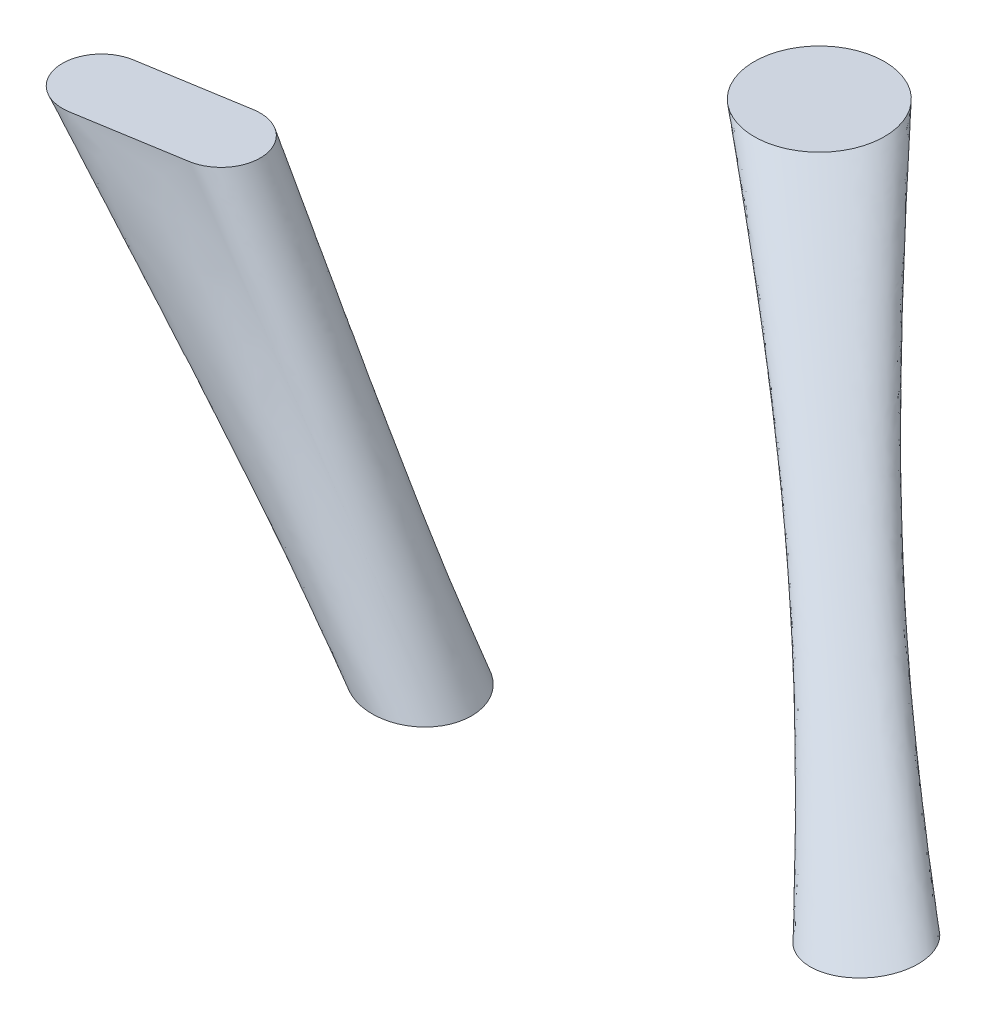
ISO-10303-21;
HEADER;
FILE_DESCRIPTION(('STEP AP214'),'2;1');
FILE_NAME('part.step','',(''),(''),'','','');
FILE_SCHEMA(('AUTOMOTIVE_DESIGN { 1 0 10303 214 1 1 1 1 }'));
ENDSEC;
DATA;
#1=APPLICATION_CONTEXT('core data for automotive mechanical design processes');
#2=APPLICATION_PROTOCOL_DEFINITION('international standard','automotive_design',2000,#1);
#3=PRODUCT_CONTEXT('',#1,'mechanical');
#4=PRODUCT('Part','Part','',(#3));
#5=PRODUCT_RELATED_PRODUCT_CATEGORY('part','',(#4));
#6=PRODUCT_DEFINITION_FORMATION('','',#4);
#7=PRODUCT_DEFINITION_CONTEXT('part definition',#1,'design');
#8=PRODUCT_DEFINITION('design','',#6,#7);
#9=PRODUCT_DEFINITION_SHAPE('','',#8);
#10=(LENGTH_UNIT() NAMED_UNIT(*) SI_UNIT(.MILLI.,.METRE.));
#11=(NAMED_UNIT(*) PLANE_ANGLE_UNIT() SI_UNIT($,.RADIAN.));
#12=(NAMED_UNIT(*) SI_UNIT($,.STERADIAN.) SOLID_ANGLE_UNIT());
#13=UNCERTAINTY_MEASURE_WITH_UNIT(LENGTH_MEASURE(1.E-05),#10,'distance_accuracy_value','');
#14=(GEOMETRIC_REPRESENTATION_CONTEXT(3) GLOBAL_UNCERTAINTY_ASSIGNED_CONTEXT((#13)) GLOBAL_UNIT_ASSIGNED_CONTEXT((#10,
#11,#12)) REPRESENTATION_CONTEXT('',''));
#15=CARTESIAN_POINT('',(0.,0.,0.));
#16=DIRECTION('',(0.,0.,1.));
#17=DIRECTION('',(1.,0.,0.));
#18=AXIS2_PLACEMENT_3D('',#15,#16,#17);
#19=CARTESIAN_POINT('',(-0.924999999999996,-1.85,-1.60214699700121));
#20=DIRECTION('',(0.,-1.,0.));
#21=DIRECTION('',(0.,0.,-1.));
#22=AXIS2_PLACEMENT_3D('',#19,#20,#21);
#23=PLANE('',#22);
#24=CARTESIAN_POINT('',(-0.924999999999996,-1.85,-1.60214699700121));
#25=DIRECTION('',(0.,-1.,0.));
#26=DIRECTION('',(0.,0.,-1.));
#27=AXIS2_PLACEMENT_3D('',#24,#25,#26);
#28=CIRCLE('',#27,0.25);
#29=CARTESIAN_POINT('',(-0.924999999999997,-1.85,-1.85214699700121));
#30=VERTEX_POINT('',#29);
#31=EDGE_CURVE('E12',#30,#30,#28,.T.);
#32=ORIENTED_EDGE('',*,*,#31,.F.);
#33=EDGE_LOOP('',(#32));
#34=FACE_BOUND('',#33,.T.);
#35=ADVANCED_FACE('F134',(#34),#23,.F.);
#36=CARTESIAN_POINT('',(0.857526099764511,-2.95078566716686,0.));
#37=DIRECTION('',(-0.0813272872809653,0.996687449676938,0.));
#38=DIRECTION('',(-0.996687449676938,-0.0813272872809654,0.));
#39=AXIS2_PLACEMENT_3D('',#36,#37,#38);
#40=PLANE('',#39);
#41=CARTESIAN_POINT('',(0.857526099764511,-2.95078566716686,0.));
#42=DIRECTION('',(-0.0813272872809653,0.996687449676938,0.));
#43=DIRECTION('',(-0.996687449676938,-0.0813272872809654,0.));
#44=AXIS2_PLACEMENT_3D('',#41,#42,#43);
#45=CIRCLE('',#44,0.2);
#46=CARTESIAN_POINT('',(0.658188609829123,-2.96705112462305,0.));
#47=VERTEX_POINT('',#46);
#48=EDGE_CURVE('E142',#47,#47,#45,.T.);
#49=ORIENTED_EDGE('',*,*,#48,.F.);
#50=EDGE_LOOP('',(#49));
#51=FACE_BOUND('',#50,.T.);
#52=ADVANCED_FACE('F167',(#51),#40,.F.);
#53=CARTESIAN_POINT('',(0.658188609829123,-2.96705112462305,0.));
#54=CARTESIAN_POINT('',(-0.924999999999997,-1.85,-1.85214699700121));
#55=CARTESIAN_POINT('',(0.658188609829123,-2.96705112462305,0.0333333333333333));
#56=CARTESIAN_POINT('',(-0.966666666666664,-1.85,-1.85214699700121));
#57=CARTESIAN_POINT('',(0.666162109426539,-2.96640050632481,0.0773333333333334));
#58=CARTESIAN_POINT('',(-1.02166666666666,-1.85,-1.84214699700121));
#59=CARTESIAN_POINT('',(0.714003107011032,-2.96249679653532,0.141333333333333));
#60=CARTESIAN_POINT('',(-1.10166666666666,-1.85,-1.78214699700121));
#61=CARTESIAN_POINT('',(0.73613025814296,-2.96069127447582,0.161707035755479));
#62=CARTESIAN_POINT('',(-1.12713379469434,-1.85,-1.75439613194931));
#63=CARTESIAN_POINT('',(0.791310186152756,-2.95618872569902,0.19123414071511));
#64=CARTESIAN_POINT('',(-1.16404267589388,-1.85,-1.68519197970018));
#65=CARTESIAN_POINT('',(0.82430318477528,-2.95349657674289,0.2));
#66=CARTESIAN_POINT('',(-1.175,-1.85,-1.64381366366788));
#67=CARTESIAN_POINT('',(0.890749014753742,-2.94807475759083,0.2));
#68=CARTESIAN_POINT('',(-1.175,-1.85,-1.56048033033455));
#69=CARTESIAN_POINT('',(0.923742013376266,-2.9453826086347,0.19123414071511));
#70=CARTESIAN_POINT('',(-1.16404267589388,-1.85,-1.51910201430225));
#71=CARTESIAN_POINT('',(0.978921941386062,-2.9408800598579,0.161707035755479));
#72=CARTESIAN_POINT('',(-1.12713379469434,-1.85,-1.44989786205312));
#73=CARTESIAN_POINT('',(1.00104909251799,-2.9390745377984,0.141333333333333));
#74=CARTESIAN_POINT('',(-1.10166666666666,-1.85,-1.42214699700121));
#75=CARTESIAN_POINT('',(1.04889009010248,-2.93517082800891,0.0773333333333335));
#76=CARTESIAN_POINT('',(-1.02166666666666,-1.85,-1.36214699700121));
#77=CARTESIAN_POINT('',(1.0568635896999,-2.93452020971066,0.0333333333333333));
#78=CARTESIAN_POINT('',(-0.966666666666663,-1.85,-1.35214699700121));
#79=CARTESIAN_POINT('',(1.0568635896999,-2.93452020971067,-0.0333333333333334));
#80=CARTESIAN_POINT('',(-0.88333333333333,-1.85,-1.35214699700121));
#81=CARTESIAN_POINT('',(1.04889009010248,-2.93517082800891,-0.0773333333333333));
#82=CARTESIAN_POINT('',(-0.82833333333333,-1.85,-1.36214699700121));
#83=CARTESIAN_POINT('',(1.00104909251799,-2.9390745377984,-0.141333333333333));
#84=CARTESIAN_POINT('',(-0.74833333333333,-1.85,-1.42214699700121));
#85=CARTESIAN_POINT('',(0.978921941386062,-2.9408800598579,-0.161707035755479));
#86=CARTESIAN_POINT('',(-0.722866205305648,-1.85,-1.44989786205312));
#87=CARTESIAN_POINT('',(0.923742013376266,-2.9453826086347,-0.19123414071511));
#88=CARTESIAN_POINT('',(-0.68595732410611,-1.85,-1.51910201430225));
#89=CARTESIAN_POINT('',(0.890749014753742,-2.94807475759083,-0.2));
#90=CARTESIAN_POINT('',(-0.674999999999996,-1.85,-1.56048033033455));
#91=CARTESIAN_POINT('',(0.82430318477528,-2.95349657674289,-0.2));
#92=CARTESIAN_POINT('',(-0.674999999999997,-1.85,-1.64381366366788));
#93=CARTESIAN_POINT('',(0.791310186152756,-2.95618872569902,-0.19123414071511));
#94=CARTESIAN_POINT('',(-0.685957324106109,-1.85,-1.68519197970018));
#95=CARTESIAN_POINT('',(0.73613025814296,-2.96069127447582,-0.161707035755479));
#96=CARTESIAN_POINT('',(-0.722866205305648,-1.85,-1.75439613194931));
#97=CARTESIAN_POINT('',(0.714003107011032,-2.96249679653532,-0.141333333333333));
#98=CARTESIAN_POINT('',(-0.74833333333333,-1.85,-1.78214699700121));
#99=CARTESIAN_POINT('',(0.666162109426539,-2.9664005063248,-0.0773333333333332));
#100=CARTESIAN_POINT('',(-0.82833333333333,-1.85,-1.84214699700121));
#101=CARTESIAN_POINT('',(0.658188609829123,-2.96705112462305,-0.0333333333333334));
#102=CARTESIAN_POINT('',(-0.88333333333333,-1.85,-1.85214699700122));
#103=CARTESIAN_POINT('',(0.658188609829123,-2.96705112462305,0.));
#104=CARTESIAN_POINT('',(-0.924999999999997,-1.85,-1.85214699700121));
#105=B_SPLINE_SURFACE_WITH_KNOTS('',3,1,((#53,#54),(#55,#56),(#57,#58),(#59,#60),(#61,#62),(#63,
#64),(#65,#66),(#67,#68),(#69,#70),(#71,#72),(#73,#74),(#75,#76),(#77,#78),(#79,#80),(#81,#82),
(#83,#84),(#85,#86),(#87,#88),(#89,#90),(#91,#92),(#93,#94),(#95,#96),(#97,#98),(#99,#100),
(#101,#102),(#103,#104)),.UNSPECIFIED.,.T.,.F.,.F.,(4,2,2,2,2,2,2,2,2,2,2,2,4),(2,2),(0.,0.125,
0.1875,0.25,0.3125,0.375,0.5,0.625,0.6875,0.75,0.8125,0.875,1.),(0.,1.),.UNSPECIFIED.);
#106=CARTESIAN_POINT('',(0.658188609829123,-2.96705112462305,0.));
#107=CARTESIAN_POINT('',(0.64169706181007,-2.95541517540823,-0.0192931978854294));
#108=CARTESIAN_POINT('',(0.625205513791017,-2.9437792261934,-0.0385863957708587));
#109=CARTESIAN_POINT('',(0.59222241775291,-2.92050732776376,-0.0771727915417173));
#110=CARTESIAN_POINT('',(0.575730869733857,-2.90887137854893,-0.0964659894271466));
#111=CARTESIAN_POINT('',(0.54274777369575,-2.88559948011929,-0.135052385198005));
#112=CARTESIAN_POINT('',(0.526256225676696,-2.87396353090446,-0.154345583083435));
#113=CARTESIAN_POINT('',(0.49327312963859,-2.85069163247482,-0.192931978854293));
#114=CARTESIAN_POINT('',(0.476781581619537,-2.83905568325999,-0.212225176739723));
#115=CARTESIAN_POINT('',(0.44379848558143,-2.81578378483035,-0.250811572510581));
#116=CARTESIAN_POINT('',(0.427306937562377,-2.80414783561552,-0.27010477039601));
#117=CARTESIAN_POINT('',(0.39432384152427,-2.78087593718588,-0.308691166166869));
#118=CARTESIAN_POINT('',(0.377832293505217,-2.76923998797105,-0.327984364052299));
#119=CARTESIAN_POINT('',(0.34484919746711,-2.74596808954141,-0.366570759823157));
#120=CARTESIAN_POINT('',(0.328357649448057,-2.73433214032658,-0.385863957708586));
#121=CARTESIAN_POINT('',(0.29537455340995,-2.71106024189694,-0.424450353479445));
#122=CARTESIAN_POINT('',(0.278883005390897,-2.69942429268211,-0.443743551364874));
#123=CARTESIAN_POINT('',(0.24589990935279,-2.67615239425247,-0.482329947135733));
#124=CARTESIAN_POINT('',(0.229408361333737,-2.66451644503764,-0.501623145021162));
#125=CARTESIAN_POINT('',(0.19642526529563,-2.641244546608,-0.540209540792021));
#126=CARTESIAN_POINT('',(0.179933717276577,-2.62960859739317,-0.55950273867745));
#127=CARTESIAN_POINT('',(0.14695062123847,-2.60633669896352,-0.598089134448309));
#128=CARTESIAN_POINT('',(0.130459073219417,-2.5947007497487,-0.617382332333738));
#129=CARTESIAN_POINT('',(0.0974759771813099,-2.57142885131905,-0.655968728104597));
#130=CARTESIAN_POINT('',(0.0809844291622566,-2.55979290210423,-0.675261925990026));
#131=CARTESIAN_POINT('',(0.0480013331241499,-2.53652100367458,-0.713848321760885));
#132=CARTESIAN_POINT('',(0.0315097851050966,-2.52488505445976,-0.733141519646314));
#133=CARTESIAN_POINT('',(-0.00147331093301008,-2.50161315603011,-0.771727915417173));
#134=CARTESIAN_POINT('',(-0.0179648589520634,-2.48997720681529,-0.791021113302602));
#135=CARTESIAN_POINT('',(-0.0509479549901701,-2.46670530838564,-0.829607509073461));
#136=CARTESIAN_POINT('',(-0.0674395030092234,-2.45506935917082,-0.84890070695889));
#137=CARTESIAN_POINT('',(-0.10042259904733,-2.43179746074117,-0.887487102729749));
#138=CARTESIAN_POINT('',(-0.116914147066383,-2.42016151152635,-0.906780300615178));
#139=CARTESIAN_POINT('',(-0.14989724310449,-2.3968896130967,-0.945366696386037));
#140=CARTESIAN_POINT('',(-0.166388791123543,-2.38525366388188,-0.964659894271466));
#141=CARTESIAN_POINT('',(-0.19937188716165,-2.36198176545223,-1.00324629004232));
#142=CARTESIAN_POINT('',(-0.215863435180703,-2.35034581623741,-1.02253948792775));
#143=CARTESIAN_POINT('',(-0.24884653121881,-2.32707391780776,-1.06112588369861));
#144=CARTESIAN_POINT('',(-0.265338079237863,-2.31543796859294,-1.08041908158404));
#145=CARTESIAN_POINT('',(-0.29832117527597,-2.29216607016329,-1.1190054773549));
#146=CARTESIAN_POINT('',(-0.314812723295023,-2.28053012094847,-1.13829867524033));
#147=CARTESIAN_POINT('',(-0.34779581933313,-2.25725822251882,-1.17688507101119));
#148=CARTESIAN_POINT('',(-0.364287367352183,-2.245622273304,-1.19617826889662));
#149=CARTESIAN_POINT('',(-0.39727046339029,-2.22235037487435,-1.23476466466748));
#150=CARTESIAN_POINT('',(-0.413762011409343,-2.21071442565953,-1.25405786255291));
#151=CARTESIAN_POINT('',(-0.44674510744745,-2.18744252722988,-1.29264425832376));
#152=CARTESIAN_POINT('',(-0.463236655466503,-2.17580657801506,-1.31193745620919));
#153=CARTESIAN_POINT('',(-0.49621975150461,-2.15253467958541,-1.35052385198005));
#154=CARTESIAN_POINT('',(-0.512711299523663,-2.14089873037059,-1.36981704986548));
#155=CARTESIAN_POINT('',(-0.54569439556177,-2.11762683194094,-1.40840344563634));
#156=CARTESIAN_POINT('',(-0.562185943580823,-2.10599088272612,-1.42769664352177));
#157=CARTESIAN_POINT('',(-0.59516903961893,-2.08271898429647,-1.46628303929263));
#158=CARTESIAN_POINT('',(-0.611660587637983,-2.07108303508165,-1.48557623717806));
#159=CARTESIAN_POINT('',(-0.64464368367609,-2.047811136652,-1.52416263294892));
#160=CARTESIAN_POINT('',(-0.661135231695143,-2.03617518743718,-1.54345583083435));
#161=CARTESIAN_POINT('',(-0.69411832773325,-2.01290328900753,-1.5820422266052));
#162=CARTESIAN_POINT('',(-0.710609875752303,-2.00126733979271,-1.60133542449063));
#163=CARTESIAN_POINT('',(-0.74359297179041,-1.97799544136306,-1.63992182026149));
#164=CARTESIAN_POINT('',(-0.760084519809463,-1.96635949214824,-1.65921501814692));
#165=CARTESIAN_POINT('',(-0.79306761584757,-1.94308759371859,-1.69780141391778));
#166=CARTESIAN_POINT('',(-0.809559163866623,-1.93145164450377,-1.71709461180321));
#167=CARTESIAN_POINT('',(-0.84254225990473,-1.90817974607412,-1.75568100757407));
#168=CARTESIAN_POINT('',(-0.859033807923783,-1.8965437968593,-1.7749742054595));
#169=CARTESIAN_POINT('',(-0.89201690396189,-1.87327189842965,-1.81356060123036));
#170=CARTESIAN_POINT('',(-0.908508451980943,-1.86163594921483,-1.83285379911578));
#171=CARTESIAN_POINT('',(-0.924999999999997,-1.85,-1.85214699700121));
#172=B_SPLINE_CURVE_WITH_KNOTS('',3,(#106,#107,#108,#109,#110,#111,#112,#113,#114,#115,#116,
#117,#118,#119,#120,#121,#122,#123,#124,#125,#126,#127,#128,#129,#130,#131,#132,#133,#134,#135,
#136,#137,#138,#139,#140,#141,#142,#143,#144,#145,#146,#147,#148,#149,#150,#151,#152,#153,#154,
#155,#156,#157,#158,#159,#160,#161,#162,#163,#164,#165,#166,#167,#168,#169,#170,#171),
.UNSPECIFIED.,.F.,.F.,(4,2,2,2,2,2,2,2,2,2,2,2,2,2,2,2,2,2,2,2,2,2,2,2,2,2,2,2,2,2,2,2,4),(0.,
0.0837636293003665,0.167527258600733,0.2512908879011,0.335054517201467,0.418818146501833,
0.5025817758022,0.586345405102566,0.670109034402933,0.7538726637033,0.837636293003666,
0.921399922304033,1.0051635516044,1.08892718090477,1.17269081020513,1.2564544395055,
1.34021806880587,1.42398169810623,1.5077453274066,1.59150895670697,1.67527258600733,
1.7590362153077,1.84279984460807,1.92656347390843,2.0103271032088,2.09409073250917,
2.17785436180953,2.2616179911099,2.34538162041027,2.42914524971063,2.512908879011,
2.59667250831137,2.68043613761173),.UNSPECIFIED.);
#173=EDGE_CURVE('BSEAM175',#47,#30,#172,.T.);
#174=ORIENTED_EDGE('',*,*,#48,.T.);
#175=ORIENTED_EDGE('',*,*,#31,.T.);
#176=ORIENTED_EDGE('',*,*,#173,.T.);
#177=ORIENTED_EDGE('',*,*,#173,.F.);
#178=EDGE_LOOP('',(#174,#176,#175,#177));
#179=FACE_BOUND('',#178,.T.);
#180=ADVANCED_FACE('F175',(#179),#105,.T.);
#181=CLOSED_SHELL('',(#35,#52,#180));
#182=MANIFOLD_SOLID_BREP('B2',#181);
#183=CARTESIAN_POINT('',(-2.19536744282352,-1.55,0.0567567567567586));
#184=DIRECTION('',(0.,1.,0.));
#185=DIRECTION('',(0.,0.,1.));
#186=AXIS2_PLACEMENT_3D('',#183,#184,#185);
#187=PLANE('',#186);
#188=CARTESIAN_POINT('',(-2.02302850014626,-1.55,0.18044705078537));
#189=CARTESIAN_POINT('',(-2.05218582074252,-1.55,0.18523868643936));
#190=CARTESIAN_POINT('',(-2.08152282127668,-1.55,0.178488624763575));
#191=CARTESIAN_POINT('',(-2.11006374121069,-1.55,0.17192173086405));
#192=CARTESIAN_POINT('',(-2.13481507014517,-1.55,0.154294467462044));
#193=CARTESIAN_POINT('',(-2.15867040041382,-1.55,0.137305311392872));
#194=CARTESIAN_POINT('',(-2.17479198495694,-1.55,0.111547920009354));
#195=CARTESIAN_POINT('',(-2.1903299677759,-1.55,0.086722946774986));
#196=CARTESIAN_POINT('',(-2.19536744282352,-1.55,0.0567567567567586));
#197=CARTESIAN_POINT('',(-2.20022256116077,-1.55,0.0278753434932129));
#198=CARTESIAN_POINT('',(-2.19340901680172,-1.55,-0.0017375643736663));
#199=CARTESIAN_POINT('',(-2.18684212290219,-1.55,-0.030278484307697));
#200=CARTESIAN_POINT('',(-2.16921485950019,-1.55,-0.0550298132421546));
#201=CARTESIAN_POINT('',(-2.15222570343103,-1.55,-0.0788851435107898));
#202=CARTESIAN_POINT('',(-2.1264683120475,-1.55,-0.0950067280539183));
#203=CARTESIAN_POINT('',(-2.10139870974175,-1.55,-0.110697824524707));
#204=CARTESIAN_POINT('',(-2.07167714879491,-1.55,-0.115582185920501));
#205=B_SPLINE_CURVE_WITH_KNOTS('',2,(#188,#189,#190,#191,#192,#193,#194,#195,#196,#197,#198,
#199,#200,#201,#202,#203,#204),.UNSPECIFIED.,.F.,.F.,(3,2,2,2,2,2,2,2,3),(0.,0.125,0.25,0.375,
0.5,0.625,0.75,0.875,1.),.UNSPECIFIED.);
#206=CARTESIAN_POINT('',(-2.02302850014626,-1.55,0.18044705078537));
#207=VERTEX_POINT('',#206);
#208=CARTESIAN_POINT('',(-2.07167714879491,-1.55,-0.115582185920501));
#209=VERTEX_POINT('',#208);
#210=EDGE_CURVE('E254',#207,#209,#205,.T.);
#211=ORIENTED_EDGE('',*,*,#210,.F.);
#212=DIRECTION('',(-0.986764122352902,0.,0.162162162162164));
#213=VECTOR('',#212,1.);
#214=CARTESIAN_POINT('',(-1.6283228512051,-1.55,0.115582185920504));
#215=LINE('',#214,#213);
#216=CARTESIAN_POINT('',(-1.6283228512051,-1.55,0.115582185920504));
#217=VERTEX_POINT('',#216);
#218=EDGE_CURVE('E132',#217,#207,#215,.T.);
#219=ORIENTED_EDGE('',*,*,#218,.F.);
#220=CARTESIAN_POINT('',(-1.67697149985375,-1.55,-0.180447050785366));
#221=CARTESIAN_POINT('',(-1.64781417925748,-1.55,-0.185238686439358));
#222=CARTESIAN_POINT('',(-1.61847717872332,-1.55,-0.178488624763572));
#223=CARTESIAN_POINT('',(-1.58993625878931,-1.55,-0.171921730864042));
#224=CARTESIAN_POINT('',(-1.56518492985483,-1.55,-0.154294467462041));
#225=CARTESIAN_POINT('',(-1.54132959958621,-1.55,-0.137305311392886));
#226=CARTESIAN_POINT('',(-1.52520801504307,-1.55,-0.111547920009351));
#227=CARTESIAN_POINT('',(-1.50967003222411,-1.55,-0.0867229467750137));
#228=CARTESIAN_POINT('',(-1.50463255717649,-1.55,-0.0567567567567555));
#229=CARTESIAN_POINT('',(-1.49977743883923,-1.55,-0.0278753434932067));
#230=CARTESIAN_POINT('',(-1.50659098319828,-1.55,0.00173756437366932));
#231=CARTESIAN_POINT('',(-1.51315787709782,-1.55,0.0302784843076949));
#232=CARTESIAN_POINT('',(-1.53078514049981,-1.55,0.0550298132421577));
#233=CARTESIAN_POINT('',(-1.54777429656897,-1.55,0.078885143510791));
#234=CARTESIAN_POINT('',(-1.5735316879525,-1.55,0.0950067280539213));
#235=CARTESIAN_POINT('',(-1.59860129025826,-1.55,0.110697824524711));
#236=CARTESIAN_POINT('',(-1.6283228512051,-1.55,0.115582185920504));
#237=B_SPLINE_CURVE_WITH_KNOTS('',2,(#220,#221,#222,#223,#224,#225,#226,#227,#228,#229,#230,
#231,#232,#233,#234,#235,#236),.UNSPECIFIED.,.F.,.F.,(3,2,2,2,2,2,2,2,3),(0.,0.125,0.25,0.375,
0.5,0.625,0.75,0.875,1.),.UNSPECIFIED.);
#238=CARTESIAN_POINT('',(-1.67697149985375,-1.55,-0.180447050785366));
#239=VERTEX_POINT('',#238);
#240=EDGE_CURVE('E235',#239,#217,#237,.T.);
#241=ORIENTED_EDGE('',*,*,#240,.F.);
#242=DIRECTION('',(0.986764122352902,0.,-0.162162162162163));
#243=VECTOR('',#242,1.);
#244=CARTESIAN_POINT('',(-2.07167714879491,-1.55,-0.115582185920501));
#245=LINE('',#244,#243);
#246=EDGE_CURVE('E243',#209,#239,#245,.T.);
#247=ORIENTED_EDGE('',*,*,#246,.F.);
#248=EDGE_LOOP('',(#211,#219,#241,#247));
#249=FACE_BOUND('',#248,.T.);
#250=ADVANCED_FACE('F225',(#249),#187,.T.);
#251=CARTESIAN_POINT('',(-0.85752609976451,-2.95078566716686,0.));
#252=DIRECTION('',(0.0813272872809655,0.996687449676938,0.));
#253=DIRECTION('',(-0.996687449676938,0.0813272872809655,0.));
#254=AXIS2_PLACEMENT_3D('',#251,#252,#253);
#255=PLANE('',#254);
#256=CARTESIAN_POINT('',(-0.85752609976451,-2.95078566716686,0.));
#257=DIRECTION('',(0.0813272872809655,0.996687449676938,0.));
#258=DIRECTION('',(-0.996687449676938,0.0813272872809655,0.));
#259=AXIS2_PLACEMENT_3D('',#256,#257,#258);
#260=CIRCLE('',#259,0.2);
#261=CARTESIAN_POINT('',(-1.0568635896999,-2.93452020971067,0.));
#262=VERTEX_POINT('',#261);
#263=EDGE_CURVE('E317',#262,#262,#260,.T.);
#264=ORIENTED_EDGE('',*,*,#263,.F.);
#265=EDGE_LOOP('',(#264));
#266=FACE_BOUND('',#265,.T.);
#267=ADVANCED_FACE('F280',(#266),#255,.F.);
#268=CARTESIAN_POINT('',(-0.680897475566171,-2.96519813605756,0.092707118681773));
#269=CARTESIAN_POINT('',(-1.62832236832577,-1.55,0.115582106565414));
#270=CARTESIAN_POINT('',(-0.669388628352136,-2.96613723017774,0.0706340940542741));
#271=CARTESIAN_POINT('',(-1.59423589998395,-1.55,0.109980428026878));
#272=CARTESIAN_POINT('',(-0.657043195020037,-2.96714458770345,0.028096806611868));
#273=CARTESIAN_POINT('',(-1.52292217083879,-1.55,0.0732033809218395));
#274=CARTESIAN_POINT('',(-0.657816696624924,-2.96708147184174,-0.0329592328127813));
#275=CARTESIAN_POINT('',(-1.48489036084237,-1.55000000000001,-0.0599998020322647));
#276=CARTESIAN_POINT('',(-0.676576144570904,-2.96555074622377,-0.0910469443395202));
#277=CARTESIAN_POINT('',(-1.56354953956259,-1.55,-0.174033577615514));
#278=CARTESIAN_POINT('',(-0.701851190417367,-2.96348836356282,-0.127375499933141));
#279=CARTESIAN_POINT('',(-1.6428845486326,-1.55,-0.186048808678992));
#280=CARTESIAN_POINT('',(-0.739578555089729,-2.96040990177818,-0.163551814787376));
#281=CARTESIAN_POINT('',(-1.71453037202133,-1.55,-0.174274726740443));
#282=CARTESIAN_POINT('',(-0.790256199983587,-2.95627472842335,-0.196375353434886));
#283=CARTESIAN_POINT('',(-1.78136728130092,-1.55,-0.163290928813972));
#284=CARTESIAN_POINT('',(-0.891354243323001,-2.94802537240218,-0.205908909956032));
#285=CARTESIAN_POINT('',(-1.87432432432433,-1.55,-0.148014618352934));
#286=CARTESIAN_POINT('',(-0.983897605300626,-2.94047405770675,-0.164437052503758));
#287=CARTESIAN_POINT('',(-1.96728136734773,-1.55,-0.132738307891896));
#288=CARTESIAN_POINT('',(-1.02147330228086,-2.93740797163926,-0.117029044926217));
#289=CARTESIAN_POINT('',(-2.03411827662733,-1.55,-0.121754509965425));
#290=CARTESIAN_POINT('',(-1.04566357117688,-2.93543410415598,-0.070634094054274));
#291=CARTESIAN_POINT('',(-2.10576410001605,-1.55,-0.109980428026875));
#292=CARTESIAN_POINT('',(-1.05800900450898,-2.93442674663027,-0.0280968066118678));
#293=CARTESIAN_POINT('',(-2.17707782916122,-1.55,-0.073203380921836));
#294=CARTESIAN_POINT('',(-1.0572355029041,-2.93448986249198,0.0329592328127813));
#295=CARTESIAN_POINT('',(-2.21510963915763,-1.55,0.0599998020322672));
#296=CARTESIAN_POINT('',(-1.03847605495812,-2.93602058810995,0.0910469443395206));
#297=CARTESIAN_POINT('',(-2.13645046043742,-1.55,0.174033577615519));
#298=CARTESIAN_POINT('',(-1.01320100911165,-2.9380829707709,0.127375499933141));
#299=CARTESIAN_POINT('',(-2.05711545136741,-1.55,0.186048808678996));
#300=CARTESIAN_POINT('',(-0.975473644439292,-2.94116143255554,0.163551814787377));
#301=CARTESIAN_POINT('',(-1.98546962797868,-1.55,0.174274726740446));
#302=CARTESIAN_POINT('',(-0.924795999545433,-2.94529660591037,0.196375353434886));
#303=CARTESIAN_POINT('',(-1.91863271869908,-1.55,0.163290928813975));
#304=CARTESIAN_POINT('',(-0.82369795620602,-2.95354596193154,0.205908909956032));
#305=CARTESIAN_POINT('',(-1.82567567567568,-1.55,0.148014618352937));
#306=CARTESIAN_POINT('',(-0.731154594228393,-2.96109727662697,0.164437052503758));
#307=CARTESIAN_POINT('',(-1.73271863265227,-1.55,0.132738307891899));
#308=CARTESIAN_POINT('',(-0.693578897248163,-2.96416336269446,0.117029044926217));
#309=CARTESIAN_POINT('',(-1.66588172337268,-1.55,0.121754509965428));
#310=CARTESIAN_POINT('',(-0.680897475566171,-2.96519813605756,0.092707118681773));
#311=CARTESIAN_POINT('',(-1.62832236832577,-1.55,0.115582106565414));
#312=B_SPLINE_SURFACE_WITH_KNOTS('',3,1,((#268,#269),(#270,#271),(#272,#273),(#274,#275),(#276,
#277),(#278,#279),(#280,#281),(#282,#283),(#284,#285),(#286,#287),(#288,#289),(#290,#291),(#292,
#293),(#294,#295),(#296,#297),(#298,#299),(#300,#301),(#302,#303),(#304,#305),(#306,#307),(#308,
#309),(#310,#311)),.UNSPECIFIED.,.T.,.F.,.F.,(4,1,1,1,2,1,1,1,2,1,1,1,2,1,1,1,4),(2,2),(0.,
0.0594704386271038,0.118940877254208,0.178411315881311,0.237881754508415,0.303411315881311,
0.368940877254208,0.434470438627104,0.5,0.559470438627104,0.618940877254208,0.678411315881311,
0.737881754508415,0.803411315881311,0.868940877254208,0.934470438627104,1.),(0.,1.),.UNSPECIFIED.);
#313=ORIENTED_EDGE('',*,*,#263,.T.);
#314=EDGE_LOOP('',(#313));
#315=FACE_BOUND('',#314,.T.);
#316=ORIENTED_EDGE('',*,*,#218,.T.);
#317=ORIENTED_EDGE('',*,*,#210,.T.);
#318=ORIENTED_EDGE('',*,*,#246,.T.);
#319=ORIENTED_EDGE('',*,*,#240,.T.);
#320=EDGE_LOOP('',(#316,#317,#318,#319));
#321=FACE_BOUND('',#320,.T.);
#322=ADVANCED_FACE('F260',(#315,#321),#312,.T.);
#323=CLOSED_SHELL('',(#250,#267,#322));
#324=MANIFOLD_SOLID_BREP('B7',#323);
#325=ADVANCED_BREP_SHAPE_REPRESENTATION('',(#18,#182,#324),#14);
#326=SHAPE_DEFINITION_REPRESENTATION(#9,#325);
ENDSEC;
END-ISO-10303-21;
